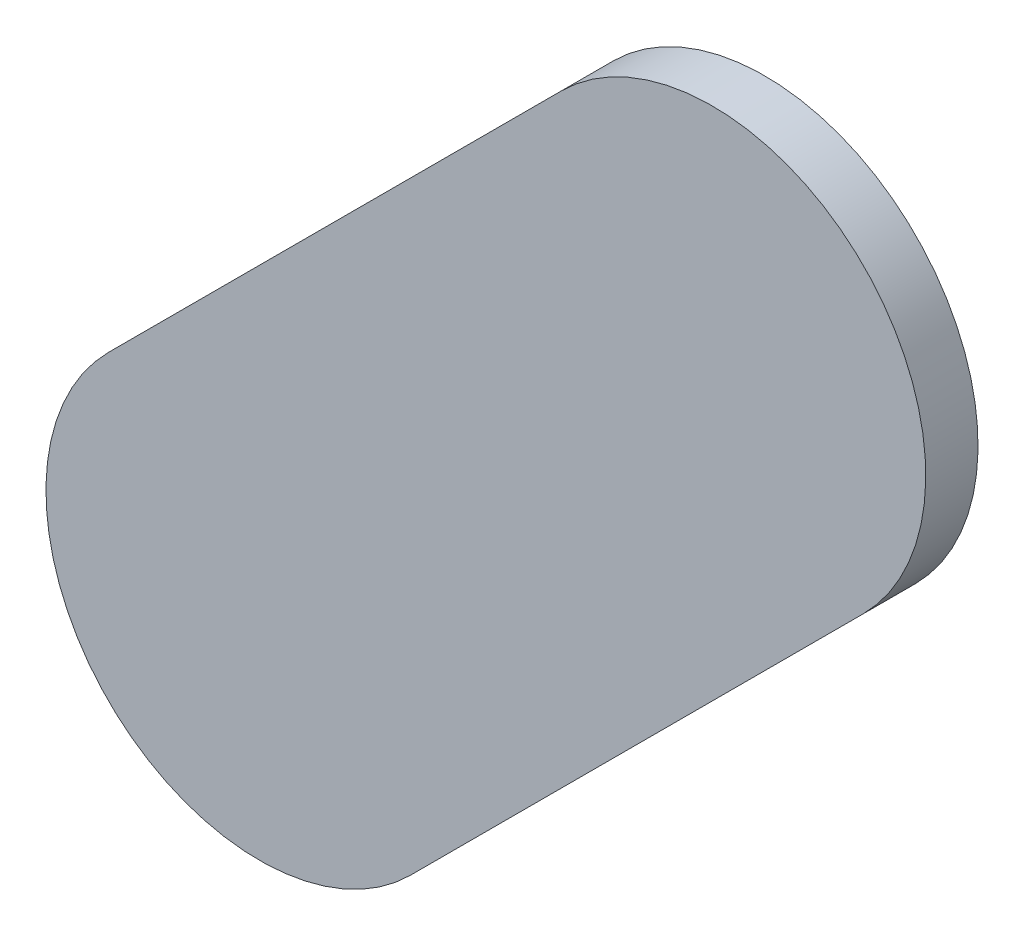
ISO-10303-21;
HEADER;
FILE_DESCRIPTION(('STEP AP214'),'2;1');
FILE_NAME('part.step','',(''),(''),'','','');
FILE_SCHEMA(('AUTOMOTIVE_DESIGN { 1 0 10303 214 1 1 1 1 }'));
ENDSEC;
DATA;
#1=APPLICATION_CONTEXT('core data for automotive mechanical design processes');
#2=APPLICATION_PROTOCOL_DEFINITION('international standard','automotive_design',2000,#1);
#3=PRODUCT_CONTEXT('',#1,'mechanical');
#4=PRODUCT('Part','Part','',(#3));
#5=PRODUCT_RELATED_PRODUCT_CATEGORY('part','',(#4));
#6=PRODUCT_DEFINITION_FORMATION('','',#4);
#7=PRODUCT_DEFINITION_CONTEXT('part definition',#1,'design');
#8=PRODUCT_DEFINITION('design','',#6,#7);
#9=PRODUCT_DEFINITION_SHAPE('','',#8);
#10=(LENGTH_UNIT() NAMED_UNIT(*) SI_UNIT(.MILLI.,.METRE.));
#11=(NAMED_UNIT(*) PLANE_ANGLE_UNIT() SI_UNIT($,.RADIAN.));
#12=(NAMED_UNIT(*) SI_UNIT($,.STERADIAN.) SOLID_ANGLE_UNIT());
#13=UNCERTAINTY_MEASURE_WITH_UNIT(LENGTH_MEASURE(1.E-05),#10,'distance_accuracy_value','');
#14=(GEOMETRIC_REPRESENTATION_CONTEXT(3) GLOBAL_UNCERTAINTY_ASSIGNED_CONTEXT((#13)) GLOBAL_UNIT_ASSIGNED_CONTEXT((#10,
#11,#12)) REPRESENTATION_CONTEXT('',''));
#15=CARTESIAN_POINT('',(0.,0.,0.));
#16=DIRECTION('',(0.,0.,1.));
#17=DIRECTION('',(1.,0.,0.));
#18=AXIS2_PLACEMENT_3D('',#15,#16,#17);
#19=CARTESIAN_POINT('',(2.31182142298,4.566695311531,0.79916));
#20=DIRECTION('',(0.,0.,1.));
#21=DIRECTION('',(1.,0.,0.));
#22=AXIS2_PLACEMENT_3D('',#19,#20,#21);
#23=PLANE('',#22);
#24=CARTESIAN_POINT('',(2.163328667,4.418202667,0.79916));
#25=DIRECTION('',(0.,0.,1.));
#26=DIRECTION('',(1.,0.,0.));
#27=AXIS2_PLACEMENT_3D('',#24,#25,#26);
#28=CIRCLE('',#27,0.139999667);
#29=CARTESIAN_POINT('',(2.26232398312215,4.31920798312204,0.79916));
#30=VERTEX_POINT('',#29);
#31=CARTESIAN_POINT('',(2.06433407191727,4.51719749971486,0.79916));
#32=VERTEX_POINT('',#31);
#33=EDGE_CURVE('E20',#30,#32,#28,.F.);
#34=ORIENTED_EDGE('',*,*,#33,.F.);
#35=DIRECTION('',(-0.707106660628037,-0.707106901745037,0.));
#36=VECTOR('',#35,1.);
#37=CARTESIAN_POINT('',(2.559308616366,4.616192717635,0.79916));
#38=LINE('',#37,#36);
#39=CARTESIAN_POINT('',(2.55930879130482,4.61619289257388,0.79916));
#40=VERTEX_POINT('',#39);
#41=EDGE_CURVE('E65',#30,#40,#38,.F.);
#42=ORIENTED_EDGE('',*,*,#41,.T.);
#43=CARTESIAN_POINT('',(2.460313667,4.715187768268,0.79916));
#44=DIRECTION('',(0.,0.,1.));
#45=DIRECTION('',(1.,0.,0.));
#46=AXIS2_PLACEMENT_3D('',#43,#44,#45);
#47=CIRCLE('',#46,0.14);
#48=CARTESIAN_POINT('',(2.36131864463338,4.81418264463353,0.79916));
#49=VERTEX_POINT('',#48);
#50=EDGE_CURVE('E57',#49,#40,#47,.F.);
#51=ORIENTED_EDGE('',*,*,#50,.F.);
#52=DIRECTION('',(0.707106099992719,0.707107462379719,0.));
#53=VECTOR('',#52,1.);
#54=CARTESIAN_POINT('',(2.0643342861,4.517197713898,0.79916));
#55=LINE('',#54,#53);
#56=EDGE_CURVE('E64',#49,#32,#55,.F.);
#57=ORIENTED_EDGE('',*,*,#56,.T.);
#58=EDGE_LOOP('',(#34,#42,#51,#57));
#59=FACE_BOUND('',#58,.T.);
#60=ADVANCED_FACE('F17',(#59),#23,.T.);
#61=CARTESIAN_POINT('',(2.559308616366,4.616192717635,0.76487));
#62=DIRECTION('',(-0.707106901745037,0.707106660628037,0.));
#63=DIRECTION('',(-0.707106660628037,-0.707106901745037,0.));
#64=AXIS2_PLACEMENT_3D('',#61,#62,#63);
#65=PLANE('',#64);
#66=DIRECTION('',(0.,0.,1.));
#67=VECTOR('',#66,1.);
#68=CARTESIAN_POINT('',(2.2623240000001,4.3192079999999,0.76487));
#69=LINE('',#68,#67);
#70=CARTESIAN_POINT('',(2.26232398312214,4.31920798312203,0.76487));
#71=VERTEX_POINT('',#70);
#72=EDGE_CURVE('E68',#71,#30,#69,.T.);
#73=ORIENTED_EDGE('',*,*,#72,.F.);
#74=DIRECTION('',(-0.70710666062813,-0.707106901744944,0.));
#75=VECTOR('',#74,1.);
#76=CARTESIAN_POINT('',(2.559308616366,4.616192717635,0.76487));
#77=LINE('',#76,#75);
#78=CARTESIAN_POINT('',(2.55930879130481,4.61619289257387,0.76487));
#79=VERTEX_POINT('',#78);
#80=EDGE_CURVE('E72',#79,#71,#77,.T.);
#81=ORIENTED_EDGE('',*,*,#80,.F.);
#82=DIRECTION('',(0.,0.,1.));
#83=VECTOR('',#82,1.);
#84=CARTESIAN_POINT('',(2.559308616366,4.616192717635,0.76487));
#85=LINE('',#84,#83);
#86=EDGE_CURVE('E60',#40,#79,#85,.F.);
#87=ORIENTED_EDGE('',*,*,#86,.F.);
#88=ORIENTED_EDGE('',*,*,#41,.F.);
#89=EDGE_LOOP('',(#73,#81,#87,#88));
#90=FACE_BOUND('',#89,.T.);
#91=ADVANCED_FACE('F70',(#90),#65,.F.);
#92=CARTESIAN_POINT('',(2.163328667,4.418202667,0.76487));
#93=DIRECTION('',(0.,0.,1.));
#94=DIRECTION('',(1.,0.,0.));
#95=AXIS2_PLACEMENT_3D('',#92,#93,#94);
#96=CYLINDRICAL_SURFACE('',#95,0.139999667);
#97=DIRECTION('',(0.,0.,1.));
#98=VECTOR('',#97,1.);
#99=CARTESIAN_POINT('',(2.0643342861,4.517197713898,0.76487));
#100=LINE('',#99,#98);
#101=CARTESIAN_POINT('',(2.06433407191729,4.51719749971488,0.76487));
#102=VERTEX_POINT('',#101);
#103=EDGE_CURVE('E77',#32,#102,#100,.F.);
#104=ORIENTED_EDGE('',*,*,#103,.T.);
#105=CARTESIAN_POINT('',(2.163329,4.418202898732,0.76487));
#106=DIRECTION('',(0.,0.,1.));
#107=DIRECTION('',(1.,0.,0.));
#108=AXIS2_PLACEMENT_3D('',#105,#106,#107);
#109=CIRCLE('',#108,0.14);
#110=EDGE_CURVE('E26',#71,#102,#109,.F.);
#111=ORIENTED_EDGE('',*,*,#110,.F.);
#112=ORIENTED_EDGE('',*,*,#72,.T.);
#113=ORIENTED_EDGE('',*,*,#33,.T.);
#114=EDGE_LOOP('',(#104,#111,#112,#113));
#115=FACE_BOUND('',#114,.T.);
#116=ADVANCED_FACE('F88',(#115),#96,.T.);
#117=CARTESIAN_POINT('',(2.0643342861,4.517197713898,0.76487));
#118=DIRECTION('',(0.707107462379719,-0.707106099992719,0.));
#119=DIRECTION('',(0.707106099992719,0.707107462379719,0.));
#120=AXIS2_PLACEMENT_3D('',#117,#118,#119);
#121=PLANE('',#120);
#122=DIRECTION('',(0.,0.,1.));
#123=VECTOR('',#122,1.);
#124=CARTESIAN_POINT('',(2.3613186669999,4.8141826670001,0.76487));
#125=LINE('',#124,#123);
#126=CARTESIAN_POINT('',(2.36131864463344,4.8141826446335,0.76487));
#127=VERTEX_POINT('',#126);
#128=EDGE_CURVE('E62',#127,#49,#125,.T.);
#129=ORIENTED_EDGE('',*,*,#128,.F.);
#130=DIRECTION('',(0.707106099992947,0.707107462379492,0.));
#131=VECTOR('',#130,1.);
#132=CARTESIAN_POINT('',(2.0643342861,4.517197713898,0.76487));
#133=LINE('',#132,#131);
#134=EDGE_CURVE('E11',#102,#127,#133,.T.);
#135=ORIENTED_EDGE('',*,*,#134,.F.);
#136=ORIENTED_EDGE('',*,*,#103,.F.);
#137=ORIENTED_EDGE('',*,*,#56,.F.);
#138=EDGE_LOOP('',(#129,#135,#136,#137));
#139=FACE_BOUND('',#138,.T.);
#140=ADVANCED_FACE('F96',(#139),#121,.F.);
#141=CARTESIAN_POINT('',(2.460313667,4.715187768268,0.76487));
#142=DIRECTION('',(0.,0.,1.));
#143=DIRECTION('',(1.,0.,0.));
#144=AXIS2_PLACEMENT_3D('',#141,#142,#143);
#145=CYLINDRICAL_SURFACE('',#144,0.14);
#146=CARTESIAN_POINT('',(2.460314,4.715188,0.76487));
#147=DIRECTION('',(0.,0.,1.));
#148=DIRECTION('',(1.,0.,0.));
#149=AXIS2_PLACEMENT_3D('',#146,#147,#148);
#150=CIRCLE('',#149,0.14);
#151=EDGE_CURVE('E35',#127,#79,#150,.F.);
#152=ORIENTED_EDGE('',*,*,#151,.F.);
#153=ORIENTED_EDGE('',*,*,#128,.T.);
#154=ORIENTED_EDGE('',*,*,#50,.T.);
#155=ORIENTED_EDGE('',*,*,#86,.T.);
#156=EDGE_LOOP('',(#152,#153,#154,#155));
#157=FACE_BOUND('',#156,.T.);
#158=ADVANCED_FACE('F58',(#157),#145,.T.);
#159=CARTESIAN_POINT('',(2.31182142298,4.566695311531,0.76487));
#160=DIRECTION('',(0.,0.,-1.));
#161=DIRECTION('',(-1.,0.,0.));
#162=AXIS2_PLACEMENT_3D('',#159,#160,#161);
#163=PLANE('',#162);
#164=ORIENTED_EDGE('',*,*,#134,.T.);
#165=ORIENTED_EDGE('',*,*,#151,.T.);
#166=ORIENTED_EDGE('',*,*,#80,.T.);
#167=ORIENTED_EDGE('',*,*,#110,.T.);
#168=EDGE_LOOP('',(#164,#165,#166,#167));
#169=FACE_BOUND('',#168,.T.);
#170=ADVANCED_FACE('F89',(#169),#163,.T.);
#171=CLOSED_SHELL('',(#60,#91,#116,#140,#158,#170));
#172=MANIFOLD_SOLID_BREP('B1',#171);
#173=ADVANCED_BREP_SHAPE_REPRESENTATION('',(#18,#172),#14);
#174=SHAPE_DEFINITION_REPRESENTATION(#9,#173);
ENDSEC;
END-ISO-10303-21;
